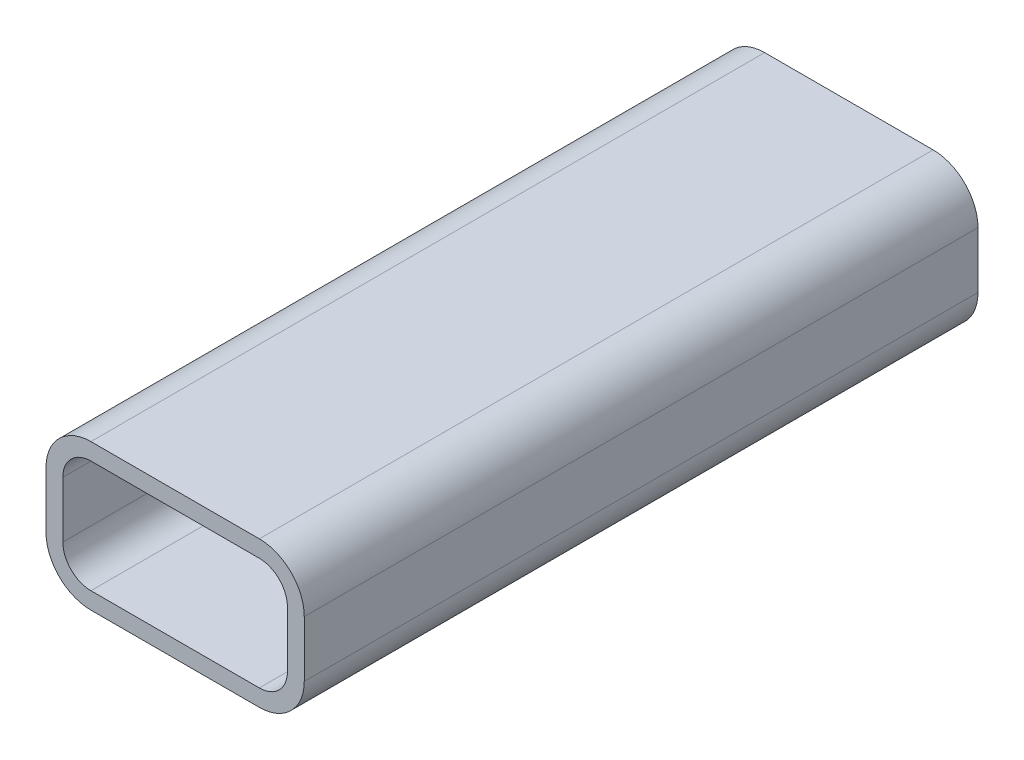
ISO-10303-21;
HEADER;
FILE_DESCRIPTION(('STEP AP214'),'2;1');
FILE_NAME('part.step','',(''),(''),'','','');
FILE_SCHEMA(('AUTOMOTIVE_DESIGN { 1 0 10303 214 1 1 1 1 }'));
ENDSEC;
DATA;
#1=APPLICATION_CONTEXT('core data for automotive mechanical design processes');
#2=APPLICATION_PROTOCOL_DEFINITION('international standard','automotive_design',2000,#1);
#3=PRODUCT_CONTEXT('',#1,'mechanical');
#4=PRODUCT('Part','Part','',(#3));
#5=PRODUCT_RELATED_PRODUCT_CATEGORY('part','',(#4));
#6=PRODUCT_DEFINITION_FORMATION('','',#4);
#7=PRODUCT_DEFINITION_CONTEXT('part definition',#1,'design');
#8=PRODUCT_DEFINITION('design','',#6,#7);
#9=PRODUCT_DEFINITION_SHAPE('','',#8);
#10=(LENGTH_UNIT() NAMED_UNIT(*) SI_UNIT(.MILLI.,.METRE.));
#11=(NAMED_UNIT(*) PLANE_ANGLE_UNIT() SI_UNIT($,.RADIAN.));
#12=(NAMED_UNIT(*) SI_UNIT($,.STERADIAN.) SOLID_ANGLE_UNIT());
#13=UNCERTAINTY_MEASURE_WITH_UNIT(LENGTH_MEASURE(1.E-05),#10,'distance_accuracy_value','');
#14=(GEOMETRIC_REPRESENTATION_CONTEXT(3) GLOBAL_UNCERTAINTY_ASSIGNED_CONTEXT((#13)) GLOBAL_UNIT_ASSIGNED_CONTEXT((#10,
#11,#12)) REPRESENTATION_CONTEXT('',''));
#15=CARTESIAN_POINT('',(0.,0.,0.));
#16=DIRECTION('',(0.,0.,1.));
#17=DIRECTION('',(1.,0.,0.));
#18=AXIS2_PLACEMENT_3D('',#15,#16,#17);
#19=CARTESIAN_POINT('',(15.,5.,60.));
#20=DIRECTION('',(0.,0.,-1.));
#21=DIRECTION('',(-1.,0.,0.));
#22=AXIS2_PLACEMENT_3D('',#19,#20,#21);
#23=PLANE('',#22);
#24=CARTESIAN_POINT('',(15.,5.,60.));
#25=DIRECTION('',(0.,0.,-1.));
#26=DIRECTION('',(-1.,0.,0.));
#27=AXIS2_PLACEMENT_3D('',#24,#25,#26);
#28=CIRCLE('',#27,8.);
#29=CARTESIAN_POINT('',(23.,5.,60.));
#30=VERTEX_POINT('',#29);
#31=CARTESIAN_POINT('',(15.,13.,60.));
#32=VERTEX_POINT('',#31);
#33=EDGE_CURVE('E290',#30,#32,#28,.F.);
#34=ORIENTED_EDGE('',*,*,#33,.T.);
#35=DIRECTION('',(-1.,0.,0.));
#36=VECTOR('',#35,1.);
#37=CARTESIAN_POINT('',(15.,13.,60.));
#38=LINE('',#37,#36);
#39=CARTESIAN_POINT('',(-15.,13.,60.));
#40=VERTEX_POINT('',#39);
#41=EDGE_CURVE('E294',#32,#40,#38,.T.);
#42=ORIENTED_EDGE('',*,*,#41,.T.);
#43=CARTESIAN_POINT('',(-15.,5.,60.));
#44=DIRECTION('',(0.,0.,-1.));
#45=DIRECTION('',(-1.,0.,0.));
#46=AXIS2_PLACEMENT_3D('',#43,#44,#45);
#47=CIRCLE('',#46,8.);
#48=CARTESIAN_POINT('',(-23.,5.,60.));
#49=VERTEX_POINT('',#48);
#50=EDGE_CURVE('E298',#40,#49,#47,.F.);
#51=ORIENTED_EDGE('',*,*,#50,.T.);
#52=DIRECTION('',(0.,-1.,0.));
#53=VECTOR('',#52,1.);
#54=CARTESIAN_POINT('',(-23.,5.00000000000003,60.));
#55=LINE('',#54,#53);
#56=CARTESIAN_POINT('',(-23.,-5.,60.));
#57=VERTEX_POINT('',#56);
#58=EDGE_CURVE('E301',#49,#57,#55,.T.);
#59=ORIENTED_EDGE('',*,*,#58,.T.);
#60=CARTESIAN_POINT('',(-15.,-5.,60.));
#61=DIRECTION('',(0.,0.,-1.));
#62=DIRECTION('',(-1.,0.,0.));
#63=AXIS2_PLACEMENT_3D('',#60,#61,#62);
#64=CIRCLE('',#63,8.);
#65=CARTESIAN_POINT('',(-15.,-13.,60.));
#66=VERTEX_POINT('',#65);
#67=EDGE_CURVE('E304',#57,#66,#64,.F.);
#68=ORIENTED_EDGE('',*,*,#67,.T.);
#69=DIRECTION('',(1.,0.,0.));
#70=VECTOR('',#69,1.);
#71=CARTESIAN_POINT('',(15.,-13.,60.));
#72=LINE('',#71,#70);
#73=CARTESIAN_POINT('',(15.,-13.,60.));
#74=VERTEX_POINT('',#73);
#75=EDGE_CURVE('E307',#66,#74,#72,.T.);
#76=ORIENTED_EDGE('',*,*,#75,.T.);
#77=CARTESIAN_POINT('',(15.,-5.,60.));
#78=DIRECTION('',(0.,0.,-1.));
#79=DIRECTION('',(-1.,0.,0.));
#80=AXIS2_PLACEMENT_3D('',#77,#78,#79);
#81=CIRCLE('',#80,8.);
#82=CARTESIAN_POINT('',(23.,-5.,60.));
#83=VERTEX_POINT('',#82);
#84=EDGE_CURVE('E310',#74,#83,#81,.F.);
#85=ORIENTED_EDGE('',*,*,#84,.T.);
#86=DIRECTION('',(0.,1.,0.));
#87=VECTOR('',#86,1.);
#88=CARTESIAN_POINT('',(23.,5.,60.));
#89=LINE('',#88,#87);
#90=EDGE_CURVE('E313',#83,#30,#89,.T.);
#91=ORIENTED_EDGE('',*,*,#90,.T.);
#92=EDGE_LOOP('',(#34,#42,#51,#59,#68,#76,#85,#91));
#93=FACE_BOUND('',#92,.T.);
#94=CARTESIAN_POINT('',(15.,5.,60.));
#95=DIRECTION('',(0.,0.,1.));
#96=DIRECTION('',(-1.,0.,0.));
#97=AXIS2_PLACEMENT_3D('',#94,#95,#96);
#98=CIRCLE('',#97,5.);
#99=CARTESIAN_POINT('',(20.,5.,60.));
#100=VERTEX_POINT('',#99);
#101=CARTESIAN_POINT('',(15.,10.,60.));
#102=VERTEX_POINT('',#101);
#103=EDGE_CURVE('E201',#100,#102,#98,.T.);
#104=ORIENTED_EDGE('',*,*,#103,.F.);
#105=DIRECTION('',(0.,1.,0.));
#106=VECTOR('',#105,1.);
#107=CARTESIAN_POINT('',(20.,5.,60.));
#108=LINE('',#107,#106);
#109=CARTESIAN_POINT('',(20.,-5.,60.));
#110=VERTEX_POINT('',#109);
#111=EDGE_CURVE('E242',#110,#100,#108,.T.);
#112=ORIENTED_EDGE('',*,*,#111,.F.);
#113=CARTESIAN_POINT('',(15.,-5.,60.));
#114=DIRECTION('',(0.,0.,1.));
#115=DIRECTION('',(-1.,0.,0.));
#116=AXIS2_PLACEMENT_3D('',#113,#114,#115);
#117=CIRCLE('',#116,5.);
#118=CARTESIAN_POINT('',(15.,-10.,60.));
#119=VERTEX_POINT('',#118);
#120=EDGE_CURVE('E239',#119,#110,#117,.T.);
#121=ORIENTED_EDGE('',*,*,#120,.F.);
#122=DIRECTION('',(1.,0.,0.));
#123=VECTOR('',#122,1.);
#124=CARTESIAN_POINT('',(-15.,-10.,60.));
#125=LINE('',#124,#123);
#126=CARTESIAN_POINT('',(-15.,-10.,60.));
#127=VERTEX_POINT('',#126);
#128=EDGE_CURVE('E236',#127,#119,#125,.T.);
#129=ORIENTED_EDGE('',*,*,#128,.F.);
#130=CARTESIAN_POINT('',(-15.,-5.,60.));
#131=DIRECTION('',(0.,0.,1.));
#132=DIRECTION('',(-1.,0.,0.));
#133=AXIS2_PLACEMENT_3D('',#130,#131,#132);
#134=CIRCLE('',#133,5.);
#135=CARTESIAN_POINT('',(-20.,-5.,60.));
#136=VERTEX_POINT('',#135);
#137=EDGE_CURVE('E233',#136,#127,#134,.T.);
#138=ORIENTED_EDGE('',*,*,#137,.F.);
#139=DIRECTION('',(0.,-1.,0.));
#140=VECTOR('',#139,1.);
#141=CARTESIAN_POINT('',(-20.,5.,60.));
#142=LINE('',#141,#140);
#143=CARTESIAN_POINT('',(-20.,5.,60.));
#144=VERTEX_POINT('',#143);
#145=EDGE_CURVE('E228',#144,#136,#142,.T.);
#146=ORIENTED_EDGE('',*,*,#145,.F.);
#147=CARTESIAN_POINT('',(-15.,5.,60.));
#148=DIRECTION('',(0.,0.,1.));
#149=DIRECTION('',(-1.,0.,0.));
#150=AXIS2_PLACEMENT_3D('',#147,#148,#149);
#151=CIRCLE('',#150,5.);
#152=CARTESIAN_POINT('',(-15.,10.,60.));
#153=VERTEX_POINT('',#152);
#154=EDGE_CURVE('E224',#153,#144,#151,.T.);
#155=ORIENTED_EDGE('',*,*,#154,.F.);
#156=DIRECTION('',(-1.,0.,0.));
#157=VECTOR('',#156,1.);
#158=CARTESIAN_POINT('',(-15.,10.,60.));
#159=LINE('',#158,#157);
#160=EDGE_CURVE('E210',#102,#153,#159,.T.);
#161=ORIENTED_EDGE('',*,*,#160,.F.);
#162=EDGE_LOOP('',(#104,#112,#121,#129,#138,#146,#155,#161));
#163=FACE_BOUND('',#162,.T.);
#164=ADVANCED_FACE('F87',(#93,#163),#23,.F.);
#165=CARTESIAN_POINT('',(15.,5.,-60.));
#166=DIRECTION('',(0.,0.,-1.));
#167=DIRECTION('',(-1.,0.,0.));
#168=AXIS2_PLACEMENT_3D('',#165,#166,#167);
#169=PLANE('',#168);
#170=CARTESIAN_POINT('',(15.,5.,-60.));
#171=DIRECTION('',(0.,0.,-1.));
#172=DIRECTION('',(-1.,0.,0.));
#173=AXIS2_PLACEMENT_3D('',#170,#171,#172);
#174=CIRCLE('',#173,8.);
#175=CARTESIAN_POINT('',(23.,5.,-60.));
#176=VERTEX_POINT('',#175);
#177=CARTESIAN_POINT('',(15.,13.,-60.));
#178=VERTEX_POINT('',#177);
#179=EDGE_CURVE('E219',#176,#178,#174,.F.);
#180=ORIENTED_EDGE('',*,*,#179,.F.);
#181=DIRECTION('',(0.,1.,0.));
#182=VECTOR('',#181,1.);
#183=CARTESIAN_POINT('',(23.,5.,-60.));
#184=LINE('',#183,#182);
#185=CARTESIAN_POINT('',(23.,-5.,-60.));
#186=VERTEX_POINT('',#185);
#187=EDGE_CURVE('E295',#186,#176,#184,.T.);
#188=ORIENTED_EDGE('',*,*,#187,.F.);
#189=CARTESIAN_POINT('',(15.,-5.,-60.));
#190=DIRECTION('',(0.,0.,-1.));
#191=DIRECTION('',(-1.,0.,0.));
#192=AXIS2_PLACEMENT_3D('',#189,#190,#191);
#193=CIRCLE('',#192,8.);
#194=CARTESIAN_POINT('',(15.,-13.,-60.));
#195=VERTEX_POINT('',#194);
#196=EDGE_CURVE('E335',#195,#186,#193,.F.);
#197=ORIENTED_EDGE('',*,*,#196,.F.);
#198=DIRECTION('',(1.,0.,0.));
#199=VECTOR('',#198,1.);
#200=CARTESIAN_POINT('',(15.,-13.,-60.));
#201=LINE('',#200,#199);
#202=CARTESIAN_POINT('',(-15.,-13.,-60.));
#203=VERTEX_POINT('',#202);
#204=EDGE_CURVE('E332',#203,#195,#201,.T.);
#205=ORIENTED_EDGE('',*,*,#204,.F.);
#206=CARTESIAN_POINT('',(-15.,-5.,-60.));
#207=DIRECTION('',(0.,0.,-1.));
#208=DIRECTION('',(-1.,0.,0.));
#209=AXIS2_PLACEMENT_3D('',#206,#207,#208);
#210=CIRCLE('',#209,8.);
#211=CARTESIAN_POINT('',(-23.,-5.,-60.));
#212=VERTEX_POINT('',#211);
#213=EDGE_CURVE('E329',#212,#203,#210,.F.);
#214=ORIENTED_EDGE('',*,*,#213,.F.);
#215=DIRECTION('',(0.,-1.,0.));
#216=VECTOR('',#215,1.);
#217=CARTESIAN_POINT('',(-23.,5.00000000000003,-60.));
#218=LINE('',#217,#216);
#219=CARTESIAN_POINT('',(-23.,5.,-60.));
#220=VERTEX_POINT('',#219);
#221=EDGE_CURVE('E326',#220,#212,#218,.T.);
#222=ORIENTED_EDGE('',*,*,#221,.F.);
#223=CARTESIAN_POINT('',(-15.,5.,-60.));
#224=DIRECTION('',(0.,0.,-1.));
#225=DIRECTION('',(-1.,0.,0.));
#226=AXIS2_PLACEMENT_3D('',#223,#224,#225);
#227=CIRCLE('',#226,8.);
#228=CARTESIAN_POINT('',(-15.,13.,-60.));
#229=VERTEX_POINT('',#228);
#230=EDGE_CURVE('E323',#229,#220,#227,.F.);
#231=ORIENTED_EDGE('',*,*,#230,.F.);
#232=DIRECTION('',(-1.,0.,0.));
#233=VECTOR('',#232,1.);
#234=CARTESIAN_POINT('',(15.,13.,-60.));
#235=LINE('',#234,#233);
#236=EDGE_CURVE('E320',#178,#229,#235,.T.);
#237=ORIENTED_EDGE('',*,*,#236,.F.);
#238=EDGE_LOOP('',(#180,#188,#197,#205,#214,#222,#231,#237));
#239=FACE_BOUND('',#238,.T.);
#240=DIRECTION('',(0.,1.,0.));
#241=VECTOR('',#240,1.);
#242=CARTESIAN_POINT('',(20.,5.,-60.));
#243=LINE('',#242,#241);
#244=CARTESIAN_POINT('',(20.,-5.,-60.));
#245=VERTEX_POINT('',#244);
#246=CARTESIAN_POINT('',(20.,5.,-60.));
#247=VERTEX_POINT('',#246);
#248=EDGE_CURVE('E211',#245,#247,#243,.T.);
#249=ORIENTED_EDGE('',*,*,#248,.T.);
#250=CARTESIAN_POINT('',(15.,5.,-60.));
#251=DIRECTION('',(0.,0.,1.));
#252=DIRECTION('',(-1.,0.,0.));
#253=AXIS2_PLACEMENT_3D('',#250,#251,#252);
#254=CIRCLE('',#253,5.);
#255=CARTESIAN_POINT('',(15.,10.,-60.));
#256=VERTEX_POINT('',#255);
#257=EDGE_CURVE('E111',#247,#256,#254,.T.);
#258=ORIENTED_EDGE('',*,*,#257,.T.);
#259=DIRECTION('',(-1.,0.,0.));
#260=VECTOR('',#259,1.);
#261=CARTESIAN_POINT('',(-15.,10.,-60.));
#262=LINE('',#261,#260);
#263=CARTESIAN_POINT('',(-15.,10.,-60.));
#264=VERTEX_POINT('',#263);
#265=EDGE_CURVE('E217',#256,#264,#262,.T.);
#266=ORIENTED_EDGE('',*,*,#265,.T.);
#267=CARTESIAN_POINT('',(-15.,5.,-60.));
#268=DIRECTION('',(0.,0.,1.));
#269=DIRECTION('',(-1.,0.,0.));
#270=AXIS2_PLACEMENT_3D('',#267,#268,#269);
#271=CIRCLE('',#270,5.);
#272=CARTESIAN_POINT('',(-20.,5.,-60.));
#273=VERTEX_POINT('',#272);
#274=EDGE_CURVE('E249',#264,#273,#271,.T.);
#275=ORIENTED_EDGE('',*,*,#274,.T.);
#276=DIRECTION('',(0.,-1.,0.));
#277=VECTOR('',#276,1.);
#278=CARTESIAN_POINT('',(-20.,5.,-60.));
#279=LINE('',#278,#277);
#280=CARTESIAN_POINT('',(-20.,-5.,-60.));
#281=VERTEX_POINT('',#280);
#282=EDGE_CURVE('E253',#273,#281,#279,.T.);
#283=ORIENTED_EDGE('',*,*,#282,.T.);
#284=CARTESIAN_POINT('',(-15.,-5.,-60.));
#285=DIRECTION('',(0.,0.,1.));
#286=DIRECTION('',(-1.,0.,0.));
#287=AXIS2_PLACEMENT_3D('',#284,#285,#286);
#288=CIRCLE('',#287,5.);
#289=CARTESIAN_POINT('',(-15.,-10.,-60.));
#290=VERTEX_POINT('',#289);
#291=EDGE_CURVE('E257',#281,#290,#288,.T.);
#292=ORIENTED_EDGE('',*,*,#291,.T.);
#293=DIRECTION('',(1.,0.,0.));
#294=VECTOR('',#293,1.);
#295=CARTESIAN_POINT('',(-15.,-10.,-60.));
#296=LINE('',#295,#294);
#297=CARTESIAN_POINT('',(15.,-10.,-60.));
#298=VERTEX_POINT('',#297);
#299=EDGE_CURVE('E261',#290,#298,#296,.T.);
#300=ORIENTED_EDGE('',*,*,#299,.T.);
#301=CARTESIAN_POINT('',(15.,-5.,-60.));
#302=DIRECTION('',(0.,0.,1.));
#303=DIRECTION('',(-1.,0.,0.));
#304=AXIS2_PLACEMENT_3D('',#301,#302,#303);
#305=CIRCLE('',#304,5.);
#306=EDGE_CURVE('E265',#298,#245,#305,.T.);
#307=ORIENTED_EDGE('',*,*,#306,.T.);
#308=EDGE_LOOP('',(#249,#258,#266,#275,#283,#292,#300,#307));
#309=FACE_BOUND('',#308,.T.);
#310=ADVANCED_FACE('F374',(#239,#309),#169,.T.);
#311=CARTESIAN_POINT('',(15.,5.,60.));
#312=DIRECTION('',(0.,0.,-1.));
#313=DIRECTION('',(-1.,0.,0.));
#314=AXIS2_PLACEMENT_3D('',#311,#312,#313);
#315=CYLINDRICAL_SURFACE('',#314,8.);
#316=ORIENTED_EDGE('',*,*,#179,.T.);
#317=DIRECTION('',(0.,0.,-1.));
#318=VECTOR('',#317,1.);
#319=CARTESIAN_POINT('',(15.,13.,60.));
#320=LINE('',#319,#318);
#321=EDGE_CURVE('E12',#32,#178,#320,.T.);
#322=ORIENTED_EDGE('',*,*,#321,.F.);
#323=ORIENTED_EDGE('',*,*,#33,.F.);
#324=DIRECTION('',(0.,0.,-1.));
#325=VECTOR('',#324,1.);
#326=CARTESIAN_POINT('',(23.,5.,60.));
#327=LINE('',#326,#325);
#328=EDGE_CURVE('E316',#30,#176,#327,.T.);
#329=ORIENTED_EDGE('',*,*,#328,.T.);
#330=EDGE_LOOP('',(#316,#322,#323,#329));
#331=FACE_BOUND('',#330,.T.);
#332=ADVANCED_FACE('F89',(#331),#315,.T.);
#333=CARTESIAN_POINT('',(15.,13.,60.));
#334=DIRECTION('',(0.,-1.,0.));
#335=DIRECTION('',(0.,0.,-1.));
#336=AXIS2_PLACEMENT_3D('',#333,#334,#335);
#337=PLANE('',#336);
#338=ORIENTED_EDGE('',*,*,#236,.T.);
#339=DIRECTION('',(0.,0.,-1.));
#340=VECTOR('',#339,1.);
#341=CARTESIAN_POINT('',(-15.,13.,60.));
#342=LINE('',#341,#340);
#343=EDGE_CURVE('E96',#40,#229,#342,.T.);
#344=ORIENTED_EDGE('',*,*,#343,.F.);
#345=ORIENTED_EDGE('',*,*,#41,.F.);
#346=ORIENTED_EDGE('',*,*,#321,.T.);
#347=EDGE_LOOP('',(#338,#344,#345,#346));
#348=FACE_BOUND('',#347,.T.);
#349=ADVANCED_FACE('F391',(#348),#337,.F.);
#350=CARTESIAN_POINT('',(-15.,5.,60.));
#351=DIRECTION('',(0.,0.,-1.));
#352=DIRECTION('',(-1.,0.,0.));
#353=AXIS2_PLACEMENT_3D('',#350,#351,#352);
#354=CYLINDRICAL_SURFACE('',#353,8.);
#355=ORIENTED_EDGE('',*,*,#230,.T.);
#356=DIRECTION('',(0.,0.,-1.));
#357=VECTOR('',#356,1.);
#358=CARTESIAN_POINT('',(-23.,5.,60.));
#359=LINE('',#358,#357);
#360=EDGE_CURVE('E359',#49,#220,#359,.T.);
#361=ORIENTED_EDGE('',*,*,#360,.F.);
#362=ORIENTED_EDGE('',*,*,#50,.F.);
#363=ORIENTED_EDGE('',*,*,#343,.T.);
#364=EDGE_LOOP('',(#355,#361,#362,#363));
#365=FACE_BOUND('',#364,.T.);
#366=ADVANCED_FACE('F368',(#365),#354,.T.);
#367=CARTESIAN_POINT('',(-23.,5.00000000000003,60.));
#368=DIRECTION('',(1.,0.,0.));
#369=DIRECTION('',(0.,1.,0.));
#370=AXIS2_PLACEMENT_3D('',#367,#368,#369);
#371=PLANE('',#370);
#372=ORIENTED_EDGE('',*,*,#221,.T.);
#373=DIRECTION('',(0.,0.,-1.));
#374=VECTOR('',#373,1.);
#375=CARTESIAN_POINT('',(-23.,-5.,60.));
#376=LINE('',#375,#374);
#377=EDGE_CURVE('E355',#57,#212,#376,.T.);
#378=ORIENTED_EDGE('',*,*,#377,.F.);
#379=ORIENTED_EDGE('',*,*,#58,.F.);
#380=ORIENTED_EDGE('',*,*,#360,.T.);
#381=EDGE_LOOP('',(#372,#378,#379,#380));
#382=FACE_BOUND('',#381,.T.);
#383=ADVANCED_FACE('F380',(#382),#371,.F.);
#384=CARTESIAN_POINT('',(-15.,-5.,60.));
#385=DIRECTION('',(0.,0.,-1.));
#386=DIRECTION('',(-1.,0.,0.));
#387=AXIS2_PLACEMENT_3D('',#384,#385,#386);
#388=CYLINDRICAL_SURFACE('',#387,8.);
#389=ORIENTED_EDGE('',*,*,#213,.T.);
#390=DIRECTION('',(0.,0.,-1.));
#391=VECTOR('',#390,1.);
#392=CARTESIAN_POINT('',(-15.,-13.,60.));
#393=LINE('',#392,#391);
#394=EDGE_CURVE('E351',#66,#203,#393,.T.);
#395=ORIENTED_EDGE('',*,*,#394,.F.);
#396=ORIENTED_EDGE('',*,*,#67,.F.);
#397=ORIENTED_EDGE('',*,*,#377,.T.);
#398=EDGE_LOOP('',(#389,#395,#396,#397));
#399=FACE_BOUND('',#398,.T.);
#400=ADVANCED_FACE('F384',(#399),#388,.T.);
#401=CARTESIAN_POINT('',(15.,-13.,60.));
#402=DIRECTION('',(0.,1.,0.));
#403=DIRECTION('',(0.,0.,1.));
#404=AXIS2_PLACEMENT_3D('',#401,#402,#403);
#405=PLANE('',#404);
#406=ORIENTED_EDGE('',*,*,#204,.T.);
#407=DIRECTION('',(0.,0.,-1.));
#408=VECTOR('',#407,1.);
#409=CARTESIAN_POINT('',(15.,-13.,60.));
#410=LINE('',#409,#408);
#411=EDGE_CURVE('E347',#74,#195,#410,.T.);
#412=ORIENTED_EDGE('',*,*,#411,.F.);
#413=ORIENTED_EDGE('',*,*,#75,.F.);
#414=ORIENTED_EDGE('',*,*,#394,.T.);
#415=EDGE_LOOP('',(#406,#412,#413,#414));
#416=FACE_BOUND('',#415,.T.);
#417=ADVANCED_FACE('F404',(#416),#405,.F.);
#418=CARTESIAN_POINT('',(15.,-5.,60.));
#419=DIRECTION('',(0.,0.,-1.));
#420=DIRECTION('',(-1.,0.,0.));
#421=AXIS2_PLACEMENT_3D('',#418,#419,#420);
#422=CYLINDRICAL_SURFACE('',#421,8.);
#423=ORIENTED_EDGE('',*,*,#196,.T.);
#424=DIRECTION('',(0.,0.,-1.));
#425=VECTOR('',#424,1.);
#426=CARTESIAN_POINT('',(23.,-5.,60.));
#427=LINE('',#426,#425);
#428=EDGE_CURVE('E343',#83,#186,#427,.T.);
#429=ORIENTED_EDGE('',*,*,#428,.F.);
#430=ORIENTED_EDGE('',*,*,#84,.F.);
#431=ORIENTED_EDGE('',*,*,#411,.T.);
#432=EDGE_LOOP('',(#423,#429,#430,#431));
#433=FACE_BOUND('',#432,.T.);
#434=ADVANCED_FACE('F402',(#433),#422,.T.);
#435=CARTESIAN_POINT('',(23.,5.,60.));
#436=DIRECTION('',(-1.,0.,0.));
#437=DIRECTION('',(0.,0.,1.));
#438=AXIS2_PLACEMENT_3D('',#435,#436,#437);
#439=PLANE('',#438);
#440=ORIENTED_EDGE('',*,*,#187,.T.);
#441=ORIENTED_EDGE('',*,*,#328,.F.);
#442=ORIENTED_EDGE('',*,*,#90,.F.);
#443=ORIENTED_EDGE('',*,*,#428,.T.);
#444=EDGE_LOOP('',(#440,#441,#442,#443));
#445=FACE_BOUND('',#444,.T.);
#446=ADVANCED_FACE('F397',(#445),#439,.F.);
#447=CARTESIAN_POINT('',(15.,5.,60.));
#448=DIRECTION('',(0.,0.,-1.));
#449=DIRECTION('',(-1.,0.,0.));
#450=AXIS2_PLACEMENT_3D('',#447,#448,#449);
#451=CYLINDRICAL_SURFACE('',#450,5.);
#452=ORIENTED_EDGE('',*,*,#257,.F.);
#453=DIRECTION('',(0.,0.,-1.));
#454=VECTOR('',#453,1.);
#455=CARTESIAN_POINT('',(20.,5.,60.));
#456=LINE('',#455,#454);
#457=EDGE_CURVE('E205',#100,#247,#456,.T.);
#458=ORIENTED_EDGE('',*,*,#457,.F.);
#459=ORIENTED_EDGE('',*,*,#103,.T.);
#460=DIRECTION('',(0.,0.,-1.));
#461=VECTOR('',#460,1.);
#462=CARTESIAN_POINT('',(15.,10.,60.));
#463=LINE('',#462,#461);
#464=EDGE_CURVE('E204',#102,#256,#463,.T.);
#465=ORIENTED_EDGE('',*,*,#464,.T.);
#466=EDGE_LOOP('',(#452,#458,#459,#465));
#467=FACE_BOUND('',#466,.T.);
#468=ADVANCED_FACE('F203',(#467),#451,.F.);
#469=CARTESIAN_POINT('',(-15.,10.,60.));
#470=DIRECTION('',(0.,-1.,0.));
#471=DIRECTION('',(0.,0.,-1.));
#472=AXIS2_PLACEMENT_3D('',#469,#470,#471);
#473=PLANE('',#472);
#474=ORIENTED_EDGE('',*,*,#265,.F.);
#475=ORIENTED_EDGE('',*,*,#464,.F.);
#476=ORIENTED_EDGE('',*,*,#160,.T.);
#477=DIRECTION('',(0.,0.,-1.));
#478=VECTOR('',#477,1.);
#479=CARTESIAN_POINT('',(-15.,10.,60.));
#480=LINE('',#479,#478);
#481=EDGE_CURVE('E220',#153,#264,#480,.T.);
#482=ORIENTED_EDGE('',*,*,#481,.T.);
#483=EDGE_LOOP('',(#474,#475,#476,#482));
#484=FACE_BOUND('',#483,.T.);
#485=ADVANCED_FACE('F214',(#484),#473,.T.);
#486=CARTESIAN_POINT('',(-15.,5.,60.));
#487=DIRECTION('',(0.,0.,-1.));
#488=DIRECTION('',(-1.,0.,0.));
#489=AXIS2_PLACEMENT_3D('',#486,#487,#488);
#490=CYLINDRICAL_SURFACE('',#489,5.);
#491=ORIENTED_EDGE('',*,*,#274,.F.);
#492=ORIENTED_EDGE('',*,*,#481,.F.);
#493=ORIENTED_EDGE('',*,*,#154,.T.);
#494=DIRECTION('',(0.,0.,-1.));
#495=VECTOR('',#494,1.);
#496=CARTESIAN_POINT('',(-20.,5.,60.));
#497=LINE('',#496,#495);
#498=EDGE_CURVE('E285',#144,#273,#497,.T.);
#499=ORIENTED_EDGE('',*,*,#498,.T.);
#500=EDGE_LOOP('',(#491,#492,#493,#499));
#501=FACE_BOUND('',#500,.T.);
#502=ADVANCED_FACE('F429',(#501),#490,.F.);
#503=CARTESIAN_POINT('',(-20.,5.,60.));
#504=DIRECTION('',(1.,0.,0.));
#505=DIRECTION('',(0.,1.,0.));
#506=AXIS2_PLACEMENT_3D('',#503,#504,#505);
#507=PLANE('',#506);
#508=ORIENTED_EDGE('',*,*,#282,.F.);
#509=ORIENTED_EDGE('',*,*,#498,.F.);
#510=ORIENTED_EDGE('',*,*,#145,.T.);
#511=DIRECTION('',(0.,0.,-1.));
#512=VECTOR('',#511,1.);
#513=CARTESIAN_POINT('',(-20.,-5.,60.));
#514=LINE('',#513,#512);
#515=EDGE_CURVE('E282',#136,#281,#514,.T.);
#516=ORIENTED_EDGE('',*,*,#515,.T.);
#517=EDGE_LOOP('',(#508,#509,#510,#516));
#518=FACE_BOUND('',#517,.T.);
#519=ADVANCED_FACE('F433',(#518),#507,.T.);
#520=CARTESIAN_POINT('',(-15.,-5.,60.));
#521=DIRECTION('',(0.,0.,-1.));
#522=DIRECTION('',(-1.,0.,0.));
#523=AXIS2_PLACEMENT_3D('',#520,#521,#522);
#524=CYLINDRICAL_SURFACE('',#523,5.);
#525=ORIENTED_EDGE('',*,*,#291,.F.);
#526=ORIENTED_EDGE('',*,*,#515,.F.);
#527=ORIENTED_EDGE('',*,*,#137,.T.);
#528=DIRECTION('',(0.,0.,-1.));
#529=VECTOR('',#528,1.);
#530=CARTESIAN_POINT('',(-15.,-10.,60.));
#531=LINE('',#530,#529);
#532=EDGE_CURVE('E279',#127,#290,#531,.T.);
#533=ORIENTED_EDGE('',*,*,#532,.T.);
#534=EDGE_LOOP('',(#525,#526,#527,#533));
#535=FACE_BOUND('',#534,.T.);
#536=ADVANCED_FACE('F439',(#535),#524,.F.);
#537=CARTESIAN_POINT('',(-15.,-10.,60.));
#538=DIRECTION('',(0.,1.,0.));
#539=DIRECTION('',(0.,0.,1.));
#540=AXIS2_PLACEMENT_3D('',#537,#538,#539);
#541=PLANE('',#540);
#542=ORIENTED_EDGE('',*,*,#299,.F.);
#543=ORIENTED_EDGE('',*,*,#532,.F.);
#544=ORIENTED_EDGE('',*,*,#128,.T.);
#545=DIRECTION('',(0.,0.,-1.));
#546=VECTOR('',#545,1.);
#547=CARTESIAN_POINT('',(15.,-10.,60.));
#548=LINE('',#547,#546);
#549=EDGE_CURVE('E276',#119,#298,#548,.T.);
#550=ORIENTED_EDGE('',*,*,#549,.T.);
#551=EDGE_LOOP('',(#542,#543,#544,#550));
#552=FACE_BOUND('',#551,.T.);
#553=ADVANCED_FACE('F443',(#552),#541,.T.);
#554=CARTESIAN_POINT('',(15.,-5.,60.));
#555=DIRECTION('',(0.,0.,-1.));
#556=DIRECTION('',(-1.,0.,0.));
#557=AXIS2_PLACEMENT_3D('',#554,#555,#556);
#558=CYLINDRICAL_SURFACE('',#557,5.);
#559=ORIENTED_EDGE('',*,*,#306,.F.);
#560=ORIENTED_EDGE('',*,*,#549,.F.);
#561=ORIENTED_EDGE('',*,*,#120,.T.);
#562=DIRECTION('',(0.,0.,-1.));
#563=VECTOR('',#562,1.);
#564=CARTESIAN_POINT('',(20.,-5.,60.));
#565=LINE('',#564,#563);
#566=EDGE_CURVE('E103',#110,#245,#565,.T.);
#567=ORIENTED_EDGE('',*,*,#566,.T.);
#568=EDGE_LOOP('',(#559,#560,#561,#567));
#569=FACE_BOUND('',#568,.T.);
#570=ADVANCED_FACE('F447',(#569),#558,.F.);
#571=CARTESIAN_POINT('',(20.,5.,60.));
#572=DIRECTION('',(-1.,0.,0.));
#573=DIRECTION('',(0.,0.,1.));
#574=AXIS2_PLACEMENT_3D('',#571,#572,#573);
#575=PLANE('',#574);
#576=ORIENTED_EDGE('',*,*,#248,.F.);
#577=ORIENTED_EDGE('',*,*,#566,.F.);
#578=ORIENTED_EDGE('',*,*,#111,.T.);
#579=ORIENTED_EDGE('',*,*,#457,.T.);
#580=EDGE_LOOP('',(#576,#577,#578,#579));
#581=FACE_BOUND('',#580,.T.);
#582=ADVANCED_FACE('F451',(#581),#575,.T.);
#583=CLOSED_SHELL('',(#164,#310,#332,#349,#366,#383,#400,#417,#434,#446,#468,#485,#502,#519,
#536,#553,#570,#582));
#584=MANIFOLD_SOLID_BREP('B2',#583);
#585=ADVANCED_BREP_SHAPE_REPRESENTATION('',(#18,#584),#14);
#586=SHAPE_DEFINITION_REPRESENTATION(#9,#585);
ENDSEC;
END-ISO-10303-21;
